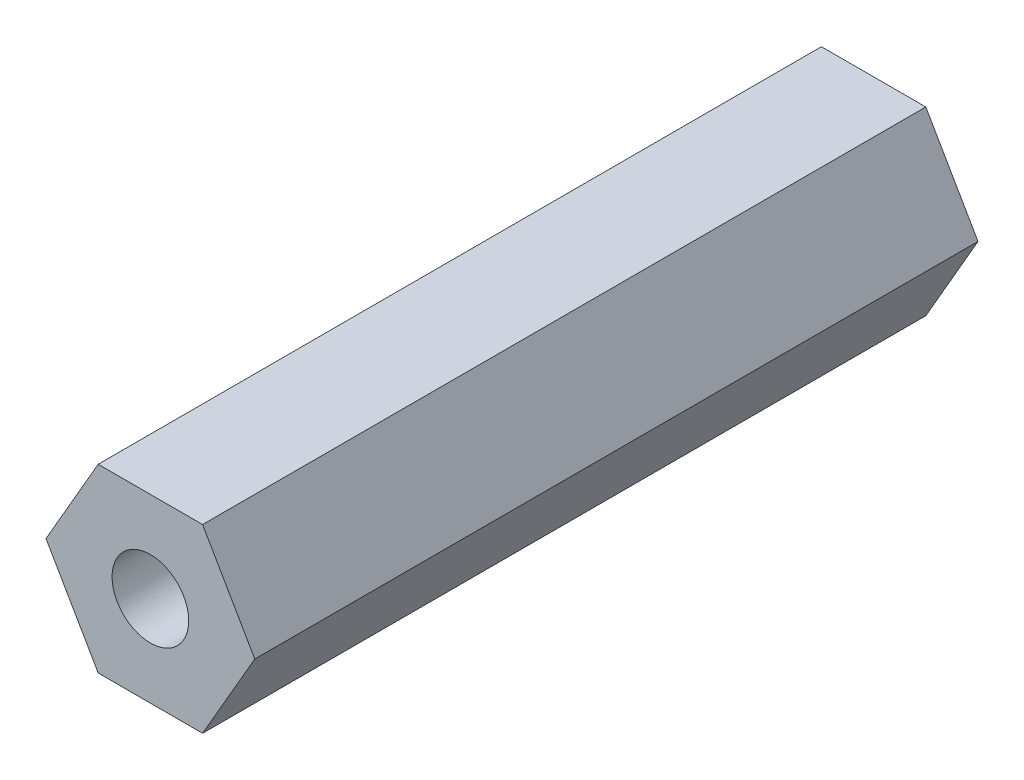
ISO-10303-21;
HEADER;
FILE_DESCRIPTION(('STEP AP214'),'2;1');
FILE_NAME('part.step','',(''),(''),'','','');
FILE_SCHEMA(('AUTOMOTIVE_DESIGN { 1 0 10303 214 1 1 1 1 }'));
ENDSEC;
DATA;
#1=APPLICATION_CONTEXT('core data for automotive mechanical design processes');
#2=APPLICATION_PROTOCOL_DEFINITION('international standard','automotive_design',2000,#1);
#3=PRODUCT_CONTEXT('',#1,'mechanical');
#4=PRODUCT('Part','Part','',(#3));
#5=PRODUCT_RELATED_PRODUCT_CATEGORY('part','',(#4));
#6=PRODUCT_DEFINITION_FORMATION('','',#4);
#7=PRODUCT_DEFINITION_CONTEXT('part definition',#1,'design');
#8=PRODUCT_DEFINITION('design','',#6,#7);
#9=PRODUCT_DEFINITION_SHAPE('','',#8);
#10=(LENGTH_UNIT() NAMED_UNIT(*) SI_UNIT(.MILLI.,.METRE.));
#11=(NAMED_UNIT(*) PLANE_ANGLE_UNIT() SI_UNIT($,.RADIAN.));
#12=(NAMED_UNIT(*) SI_UNIT($,.STERADIAN.) SOLID_ANGLE_UNIT());
#13=UNCERTAINTY_MEASURE_WITH_UNIT(LENGTH_MEASURE(1.E-05),#10,'distance_accuracy_value','');
#14=(GEOMETRIC_REPRESENTATION_CONTEXT(3) GLOBAL_UNCERTAINTY_ASSIGNED_CONTEXT((#13)) GLOBAL_UNIT_ASSIGNED_CONTEXT((#10,
#11,#12)) REPRESENTATION_CONTEXT('',''));
#15=CARTESIAN_POINT('',(0.,0.,0.));
#16=DIRECTION('',(0.,0.,1.));
#17=DIRECTION('',(1.,0.,0.));
#18=AXIS2_PLACEMENT_3D('',#15,#16,#17);
#19=CARTESIAN_POINT('',(2.74963065701559,-4.7625,38.1));
#20=DIRECTION('',(-0.866025403784439,0.5,0.));
#21=DIRECTION('',(-0.5,-0.866025403784439,0.));
#22=AXIS2_PLACEMENT_3D('',#19,#20,#21);
#23=PLANE('',#22);
#24=DIRECTION('',(0.,0.,1.));
#25=VECTOR('',#24,1.);
#26=CARTESIAN_POINT('',(5.49926131403118,0.,38.1));
#27=LINE('',#26,#25);
#28=CARTESIAN_POINT('',(5.49926131403118,0.,0.));
#29=VERTEX_POINT('',#28);
#30=CARTESIAN_POINT('',(5.49926131403118,0.,38.1));
#31=VERTEX_POINT('',#30);
#32=EDGE_CURVE('E65',#29,#31,#27,.T.);
#33=ORIENTED_EDGE('',*,*,#32,.T.);
#34=DIRECTION('',(0.5,0.866025403784439,0.));
#35=VECTOR('',#34,1.);
#36=CARTESIAN_POINT('',(2.74963065701559,-4.7625,38.1));
#37=LINE('',#36,#35);
#38=CARTESIAN_POINT('',(2.74963065701559,-4.7625,38.1));
#39=VERTEX_POINT('',#38);
#40=EDGE_CURVE('E106',#39,#31,#37,.T.);
#41=ORIENTED_EDGE('',*,*,#40,.F.);
#42=DIRECTION('',(0.,0.,1.));
#43=VECTOR('',#42,1.);
#44=CARTESIAN_POINT('',(2.74963065701559,-4.7625,38.1));
#45=LINE('',#44,#43);
#46=CARTESIAN_POINT('',(2.74963065701559,-4.7625,0.));
#47=VERTEX_POINT('',#46);
#48=EDGE_CURVE('E93',#39,#47,#45,.F.);
#49=ORIENTED_EDGE('',*,*,#48,.T.);
#50=DIRECTION('',(0.5,0.866025403784439,0.));
#51=VECTOR('',#50,1.);
#52=CARTESIAN_POINT('',(2.74963065701559,-4.7625,0.));
#53=LINE('',#52,#51);
#54=EDGE_CURVE('E107',#47,#29,#53,.T.);
#55=ORIENTED_EDGE('',*,*,#54,.T.);
#56=EDGE_LOOP('',(#33,#41,#49,#55));
#57=FACE_BOUND('',#56,.T.);
#58=ADVANCED_FACE('F16',(#57),#23,.F.);
#59=CARTESIAN_POINT('',(5.49926131403118,0.,38.1));
#60=DIRECTION('',(-0.866025403784439,-0.5,0.));
#61=DIRECTION('',(0.5,-0.866025403784439,0.));
#62=AXIS2_PLACEMENT_3D('',#59,#60,#61);
#63=PLANE('',#62);
#64=DIRECTION('',(0.,0.,1.));
#65=VECTOR('',#64,1.);
#66=CARTESIAN_POINT('',(2.74963065701559,4.7625,38.1));
#67=LINE('',#66,#65);
#68=CARTESIAN_POINT('',(2.74963065701559,4.7625,0.));
#69=VERTEX_POINT('',#68);
#70=CARTESIAN_POINT('',(2.74963065701559,4.7625,38.1));
#71=VERTEX_POINT('',#70);
#72=EDGE_CURVE('E72',#69,#71,#67,.T.);
#73=ORIENTED_EDGE('',*,*,#72,.T.);
#74=DIRECTION('',(-0.5,0.866025403784439,0.));
#75=VECTOR('',#74,1.);
#76=CARTESIAN_POINT('',(5.49926131403118,0.,38.1));
#77=LINE('',#76,#75);
#78=EDGE_CURVE('E108',#31,#71,#77,.T.);
#79=ORIENTED_EDGE('',*,*,#78,.F.);
#80=ORIENTED_EDGE('',*,*,#32,.F.);
#81=DIRECTION('',(-0.5,0.866025403784439,0.));
#82=VECTOR('',#81,1.);
#83=CARTESIAN_POINT('',(5.49926131403118,0.,0.));
#84=LINE('',#83,#82);
#85=EDGE_CURVE('E86',#29,#69,#84,.T.);
#86=ORIENTED_EDGE('',*,*,#85,.T.);
#87=EDGE_LOOP('',(#73,#79,#80,#86));
#88=FACE_BOUND('',#87,.T.);
#89=ADVANCED_FACE('F92',(#88),#63,.F.);
#90=CARTESIAN_POINT('',(2.74963065701559,4.7625,38.1));
#91=DIRECTION('',(0.,-1.,0.));
#92=DIRECTION('',(1.,0.,0.));
#93=AXIS2_PLACEMENT_3D('',#90,#91,#92);
#94=PLANE('',#93);
#95=DIRECTION('',(0.,0.,1.));
#96=VECTOR('',#95,1.);
#97=CARTESIAN_POINT('',(-2.74963065701559,4.7625,38.1));
#98=LINE('',#97,#96);
#99=CARTESIAN_POINT('',(-2.74963065701559,4.7625,0.));
#100=VERTEX_POINT('',#99);
#101=CARTESIAN_POINT('',(-2.74963065701559,4.7625,38.1));
#102=VERTEX_POINT('',#101);
#103=EDGE_CURVE('E78',#100,#102,#98,.T.);
#104=ORIENTED_EDGE('',*,*,#103,.T.);
#105=DIRECTION('',(1.,0.,0.));
#106=VECTOR('',#105,1.);
#107=CARTESIAN_POINT('',(0.,4.7625,38.1));
#108=LINE('',#107,#106);
#109=EDGE_CURVE('E77',#71,#102,#108,.F.);
#110=ORIENTED_EDGE('',*,*,#109,.F.);
#111=ORIENTED_EDGE('',*,*,#72,.F.);
#112=DIRECTION('',(1.,0.,0.));
#113=VECTOR('',#112,1.);
#114=CARTESIAN_POINT('',(0.,4.7625,0.));
#115=LINE('',#114,#113);
#116=EDGE_CURVE('E76',#69,#100,#115,.F.);
#117=ORIENTED_EDGE('',*,*,#116,.T.);
#118=EDGE_LOOP('',(#104,#110,#111,#117));
#119=FACE_BOUND('',#118,.T.);
#120=ADVANCED_FACE('F75',(#119),#94,.F.);
#121=CARTESIAN_POINT('',(-2.74963065701559,4.7625,38.1));
#122=DIRECTION('',(0.866025403784439,-0.5,0.));
#123=DIRECTION('',(0.5,0.866025403784439,0.));
#124=AXIS2_PLACEMENT_3D('',#121,#122,#123);
#125=PLANE('',#124);
#126=DIRECTION('',(0.,0.,1.));
#127=VECTOR('',#126,1.);
#128=CARTESIAN_POINT('',(-5.49926131403119,0.,38.1));
#129=LINE('',#128,#127);
#130=CARTESIAN_POINT('',(-5.49926131403119,0.,0.));
#131=VERTEX_POINT('',#130);
#132=CARTESIAN_POINT('',(-5.49926131403119,0.,38.1));
#133=VERTEX_POINT('',#132);
#134=EDGE_CURVE('E100',#131,#133,#129,.T.);
#135=ORIENTED_EDGE('',*,*,#134,.T.);
#136=DIRECTION('',(-0.5,-0.866025403784439,0.));
#137=VECTOR('',#136,1.);
#138=CARTESIAN_POINT('',(-2.74963065701559,4.7625,38.1));
#139=LINE('',#138,#137);
#140=EDGE_CURVE('E110',#102,#133,#139,.T.);
#141=ORIENTED_EDGE('',*,*,#140,.F.);
#142=ORIENTED_EDGE('',*,*,#103,.F.);
#143=DIRECTION('',(-0.5,-0.866025403784439,0.));
#144=VECTOR('',#143,1.);
#145=CARTESIAN_POINT('',(-2.74963065701559,4.7625,0.));
#146=LINE('',#145,#144);
#147=EDGE_CURVE('E90',#100,#131,#146,.T.);
#148=ORIENTED_EDGE('',*,*,#147,.T.);
#149=EDGE_LOOP('',(#135,#141,#142,#148));
#150=FACE_BOUND('',#149,.T.);
#151=ADVANCED_FACE('F122',(#150),#125,.F.);
#152=CARTESIAN_POINT('',(-5.49926131403119,0.,38.1));
#153=DIRECTION('',(0.866025403784439,0.5,0.));
#154=DIRECTION('',(-0.5,0.866025403784439,0.));
#155=AXIS2_PLACEMENT_3D('',#152,#153,#154);
#156=PLANE('',#155);
#157=DIRECTION('',(0.,0.,1.));
#158=VECTOR('',#157,1.);
#159=CARTESIAN_POINT('',(-2.7496306570156,-4.7625,38.1));
#160=LINE('',#159,#158);
#161=CARTESIAN_POINT('',(-2.7496306570156,-4.7625,0.));
#162=VERTEX_POINT('',#161);
#163=CARTESIAN_POINT('',(-2.7496306570156,-4.7625,38.1));
#164=VERTEX_POINT('',#163);
#165=EDGE_CURVE('E95',#162,#164,#160,.T.);
#166=ORIENTED_EDGE('',*,*,#165,.T.);
#167=DIRECTION('',(0.5,-0.866025403784439,0.));
#168=VECTOR('',#167,1.);
#169=CARTESIAN_POINT('',(-5.49926131403119,0.,38.1));
#170=LINE('',#169,#168);
#171=EDGE_CURVE('E32',#133,#164,#170,.T.);
#172=ORIENTED_EDGE('',*,*,#171,.F.);
#173=ORIENTED_EDGE('',*,*,#134,.F.);
#174=DIRECTION('',(0.5,-0.866025403784439,0.));
#175=VECTOR('',#174,1.);
#176=CARTESIAN_POINT('',(-5.49926131403119,0.,0.));
#177=LINE('',#176,#175);
#178=EDGE_CURVE('E119',#131,#162,#177,.T.);
#179=ORIENTED_EDGE('',*,*,#178,.T.);
#180=EDGE_LOOP('',(#166,#172,#173,#179));
#181=FACE_BOUND('',#180,.T.);
#182=ADVANCED_FACE('F149',(#181),#156,.F.);
#183=CARTESIAN_POINT('',(-2.7496306570156,-4.7625,38.1));
#184=DIRECTION('',(0.,1.,0.));
#185=DIRECTION('',(-1.,0.,0.));
#186=AXIS2_PLACEMENT_3D('',#183,#184,#185);
#187=PLANE('',#186);
#188=ORIENTED_EDGE('',*,*,#48,.F.);
#189=DIRECTION('',(1.,0.,0.));
#190=VECTOR('',#189,1.);
#191=CARTESIAN_POINT('',(0.,-4.7625,38.1));
#192=LINE('',#191,#190);
#193=EDGE_CURVE('E124',#164,#39,#192,.T.);
#194=ORIENTED_EDGE('',*,*,#193,.F.);
#195=ORIENTED_EDGE('',*,*,#165,.F.);
#196=DIRECTION('',(1.,0.,0.));
#197=VECTOR('',#196,1.);
#198=CARTESIAN_POINT('',(0.,-4.7625,0.));
#199=LINE('',#198,#197);
#200=EDGE_CURVE('E116',#162,#47,#199,.T.);
#201=ORIENTED_EDGE('',*,*,#200,.T.);
#202=EDGE_LOOP('',(#188,#194,#195,#201));
#203=FACE_BOUND('',#202,.T.);
#204=ADVANCED_FACE('F144',(#203),#187,.F.);
#205=CARTESIAN_POINT('',(0.,0.,0.));
#206=DIRECTION('',(0.,0.,1.));
#207=DIRECTION('',(1.,0.,0.));
#208=AXIS2_PLACEMENT_3D('',#205,#206,#207);
#209=PLANE('',#208);
#210=ORIENTED_EDGE('',*,*,#200,.F.);
#211=ORIENTED_EDGE('',*,*,#178,.F.);
#212=ORIENTED_EDGE('',*,*,#147,.F.);
#213=ORIENTED_EDGE('',*,*,#116,.F.);
#214=ORIENTED_EDGE('',*,*,#85,.F.);
#215=ORIENTED_EDGE('',*,*,#54,.F.);
#216=EDGE_LOOP('',(#210,#211,#212,#213,#214,#215));
#217=FACE_BOUND('',#216,.T.);
#218=CARTESIAN_POINT('',(0.,0.,0.));
#219=DIRECTION('',(0.,0.,-1.));
#220=DIRECTION('',(-1.,0.,0.));
#221=AXIS2_PLACEMENT_3D('',#218,#219,#220);
#222=CIRCLE('',#221,2.01929999999999);
#223=CARTESIAN_POINT('',(-2.01929999999999,0.,0.));
#224=VERTEX_POINT('',#223);
#225=EDGE_CURVE('E19',#224,#224,#222,.F.);
#226=ORIENTED_EDGE('',*,*,#225,.T.);
#227=EDGE_LOOP('',(#226));
#228=FACE_BOUND('',#227,.T.);
#229=ADVANCED_FACE('F83',(#217,#228),#209,.F.);
#230=CARTESIAN_POINT('',(0.,0.,38.1));
#231=DIRECTION('',(0.,0.,1.));
#232=DIRECTION('',(1.,0.,0.));
#233=AXIS2_PLACEMENT_3D('',#230,#231,#232);
#234=PLANE('',#233);
#235=ORIENTED_EDGE('',*,*,#171,.T.);
#236=ORIENTED_EDGE('',*,*,#193,.T.);
#237=ORIENTED_EDGE('',*,*,#40,.T.);
#238=ORIENTED_EDGE('',*,*,#78,.T.);
#239=ORIENTED_EDGE('',*,*,#109,.T.);
#240=ORIENTED_EDGE('',*,*,#140,.T.);
#241=EDGE_LOOP('',(#235,#236,#237,#238,#239,#240));
#242=FACE_BOUND('',#241,.T.);
#243=CARTESIAN_POINT('',(0.,0.,38.1));
#244=DIRECTION('',(0.,0.,-1.));
#245=DIRECTION('',(-1.,0.,0.));
#246=AXIS2_PLACEMENT_3D('',#243,#244,#245);
#247=CIRCLE('',#246,2.01929999999999);
#248=CARTESIAN_POINT('',(-2.01929999999999,0.,38.1));
#249=VERTEX_POINT('',#248);
#250=EDGE_CURVE('E11',#249,#249,#247,.T.);
#251=ORIENTED_EDGE('',*,*,#250,.T.);
#252=EDGE_LOOP('',(#251));
#253=FACE_BOUND('',#252,.T.);
#254=ADVANCED_FACE('F134',(#242,#253),#234,.T.);
#255=CARTESIAN_POINT('',(0.,0.,0.));
#256=DIRECTION('',(0.,0.,-1.));
#257=DIRECTION('',(-1.,0.,0.));
#258=AXIS2_PLACEMENT_3D('',#255,#256,#257);
#259=CYLINDRICAL_SURFACE('',#258,2.01929999999999);
#260=ORIENTED_EDGE('',*,*,#225,.F.);
#261=EDGE_LOOP('',(#260));
#262=FACE_BOUND('',#261,.T.);
#263=ORIENTED_EDGE('',*,*,#250,.F.);
#264=EDGE_LOOP('',(#263));
#265=FACE_BOUND('',#264,.T.);
#266=ADVANCED_FACE('F131',(#262,#265),#259,.F.);
#267=CLOSED_SHELL('',(#58,#89,#120,#151,#182,#204,#229,#254,#266));
#268=MANIFOLD_SOLID_BREP('B1',#267);
#269=ADVANCED_BREP_SHAPE_REPRESENTATION('',(#18,#268),#14);
#270=SHAPE_DEFINITION_REPRESENTATION(#9,#269);
ENDSEC;
END-ISO-10303-21;
